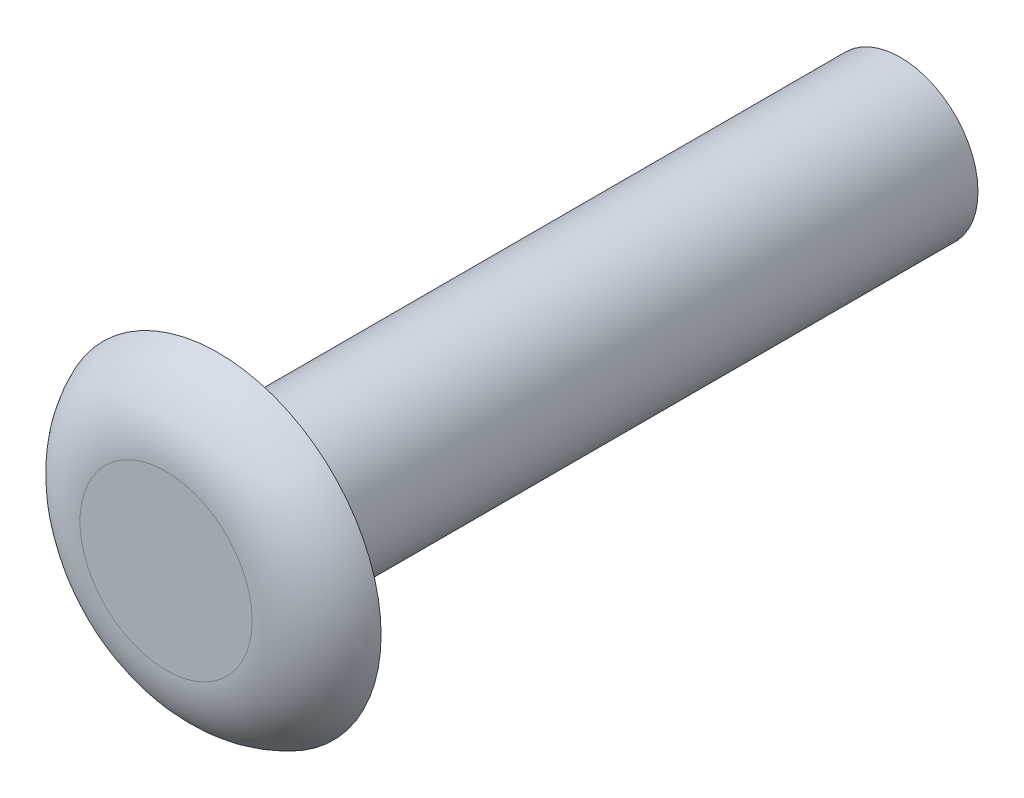
ISO-10303-21;
HEADER;
FILE_DESCRIPTION(('STEP AP214'),'2;1');
FILE_NAME('part.step','',(''),(''),'','','');
FILE_SCHEMA(('AUTOMOTIVE_DESIGN { 1 0 10303 214 1 1 1 1 }'));
ENDSEC;
DATA;
#1=APPLICATION_CONTEXT('core data for automotive mechanical design processes');
#2=APPLICATION_PROTOCOL_DEFINITION('international standard','automotive_design',2000,#1);
#3=PRODUCT_CONTEXT('',#1,'mechanical');
#4=PRODUCT('Part','Part','',(#3));
#5=PRODUCT_RELATED_PRODUCT_CATEGORY('part','',(#4));
#6=PRODUCT_DEFINITION_FORMATION('','',#4);
#7=PRODUCT_DEFINITION_CONTEXT('part definition',#1,'design');
#8=PRODUCT_DEFINITION('design','',#6,#7);
#9=PRODUCT_DEFINITION_SHAPE('','',#8);
#10=(LENGTH_UNIT() NAMED_UNIT(*) SI_UNIT(.MILLI.,.METRE.));
#11=(NAMED_UNIT(*) PLANE_ANGLE_UNIT() SI_UNIT($,.RADIAN.));
#12=(NAMED_UNIT(*) SI_UNIT($,.STERADIAN.) SOLID_ANGLE_UNIT());
#13=UNCERTAINTY_MEASURE_WITH_UNIT(LENGTH_MEASURE(1.E-05),#10,'distance_accuracy_value','');
#14=(GEOMETRIC_REPRESENTATION_CONTEXT(3) GLOBAL_UNCERTAINTY_ASSIGNED_CONTEXT((#13)) GLOBAL_UNIT_ASSIGNED_CONTEXT((#10,
#11,#12)) REPRESENTATION_CONTEXT('',''));
#15=CARTESIAN_POINT('',(0.,0.,0.));
#16=DIRECTION('',(0.,0.,1.));
#17=DIRECTION('',(1.,0.,0.));
#18=AXIS2_PLACEMENT_3D('',#15,#16,#17);
#19=CARTESIAN_POINT('',(0.,0.,1.6002));
#20=DIRECTION('',(0.,0.,1.));
#21=DIRECTION('',(1.,0.,0.));
#22=AXIS2_PLACEMENT_3D('',#19,#20,#21);
#23=PLANE('',#22);
#24=CARTESIAN_POINT('',(0.,0.,1.6002));
#25=DIRECTION('',(0.,0.,1.));
#26=DIRECTION('',(1.,0.,0.));
#27=AXIS2_PLACEMENT_3D('',#24,#25,#26);
#28=CIRCLE('',#27,2.64405934475841);
#29=CARTESIAN_POINT('',(2.64405934475841,0.,1.6002));
#30=VERTEX_POINT('',#29);
#31=EDGE_CURVE('E10',#30,#30,#28,.T.);
#32=ORIENTED_EDGE('',*,*,#31,.T.);
#33=EDGE_LOOP('',(#32));
#34=FACE_BOUND('',#33,.T.);
#35=ADVANCED_FACE('F32',(#34),#23,.T.);
#36=CARTESIAN_POINT('',(0.,0.,0.));
#37=DIRECTION('',(0.,0.,1.));
#38=DIRECTION('',(1.,0.,0.));
#39=AXIS2_PLACEMENT_3D('',#36,#37,#38);
#40=PLANE('',#39);
#41=CARTESIAN_POINT('',(0.,0.,0.));
#42=DIRECTION('',(0.,0.,1.));
#43=DIRECTION('',(1.,0.,0.));
#44=AXIS2_PLACEMENT_3D('',#41,#42,#43);
#45=CIRCLE('',#44,2.38125);
#46=CARTESIAN_POINT('',(2.38125,0.,0.));
#47=VERTEX_POINT('',#46);
#48=EDGE_CURVE('E47',#47,#47,#45,.T.);
#49=ORIENTED_EDGE('',*,*,#48,.T.);
#50=EDGE_LOOP('',(#49));
#51=FACE_BOUND('',#50,.T.);
#52=CARTESIAN_POINT('',(0.,0.,0.));
#53=DIRECTION('',(0.,0.,1.));
#54=DIRECTION('',(1.,0.,0.));
#55=AXIS2_PLACEMENT_3D('',#52,#53,#54);
#56=CIRCLE('',#55,5.0038);
#57=CARTESIAN_POINT('',(5.0038,0.,0.));
#58=VERTEX_POINT('',#57);
#59=EDGE_CURVE('E39',#58,#58,#56,.T.);
#60=ORIENTED_EDGE('',*,*,#59,.F.);
#61=EDGE_LOOP('',(#60));
#62=FACE_BOUND('',#61,.T.);
#63=ADVANCED_FACE('F53',(#51,#62),#40,.F.);
#64=CARTESIAN_POINT('',(0.,0.,-20.955));
#65=DIRECTION('',(0.,0.,1.));
#66=DIRECTION('',(1.,0.,0.));
#67=AXIS2_PLACEMENT_3D('',#64,#65,#66);
#68=CYLINDRICAL_SURFACE('',#67,2.38125);
#69=CARTESIAN_POINT('',(0.,0.,-20.955));
#70=DIRECTION('',(0.,0.,1.));
#71=DIRECTION('',(1.,0.,0.));
#72=AXIS2_PLACEMENT_3D('',#69,#70,#71);
#73=CIRCLE('',#72,2.38125);
#74=CARTESIAN_POINT('',(2.38125,0.,-20.955));
#75=VERTEX_POINT('',#74);
#76=EDGE_CURVE('E43',#75,#75,#73,.T.);
#77=ORIENTED_EDGE('',*,*,#76,.T.);
#78=EDGE_LOOP('',(#77));
#79=FACE_BOUND('',#78,.T.);
#80=ORIENTED_EDGE('',*,*,#48,.F.);
#81=EDGE_LOOP('',(#80));
#82=FACE_BOUND('',#81,.T.);
#83=ADVANCED_FACE('F56',(#79,#82),#68,.T.);
#84=CARTESIAN_POINT('',(0.,0.,-20.955));
#85=DIRECTION('',(0.,0.,1.));
#86=DIRECTION('',(1.,0.,0.));
#87=AXIS2_PLACEMENT_3D('',#84,#85,#86);
#88=PLANE('',#87);
#89=ORIENTED_EDGE('',*,*,#76,.F.);
#90=EDGE_LOOP('',(#89));
#91=FACE_BOUND('',#90,.T.);
#92=ADVANCED_FACE('F58',(#91),#88,.F.);
#93=CARTESIAN_POINT('',(0.,0.,-0.9398));
#94=DIRECTION('',(0.,0.,-1.));
#95=DIRECTION('',(-1.,0.,0.));
#96=AXIS2_PLACEMENT_3D('',#93,#94,#95);
#97=TOROIDAL_SURFACE('',#96,2.64405934475841,2.54);
#98=ORIENTED_EDGE('',*,*,#59,.T.);
#99=EDGE_LOOP('',(#98));
#100=FACE_BOUND('',#99,.T.);
#101=ORIENTED_EDGE('',*,*,#31,.F.);
#102=EDGE_LOOP('',(#101));
#103=FACE_BOUND('',#102,.T.);
#104=ADVANCED_FACE('F34',(#100,#103),#97,.T.);
#105=CLOSED_SHELL('',(#35,#63,#83,#92,#104));
#106=MANIFOLD_SOLID_BREP('B2',#105);
#107=ADVANCED_BREP_SHAPE_REPRESENTATION('',(#18,#106),#14);
#108=SHAPE_DEFINITION_REPRESENTATION(#9,#107);
ENDSEC;
END-ISO-10303-21;
